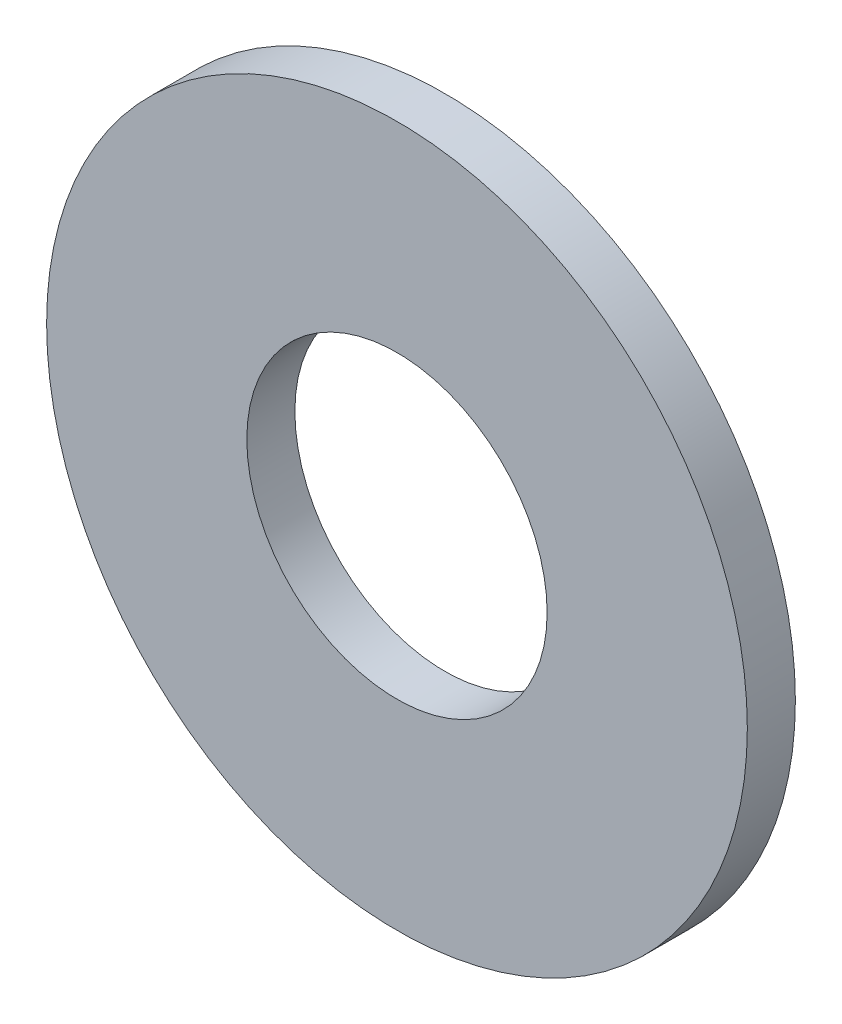
ISO-10303-21;
HEADER;
FILE_DESCRIPTION(('STEP AP214'),'2;1');
FILE_NAME('part.step','',(''),(''),'','','');
FILE_SCHEMA(('AUTOMOTIVE_DESIGN { 1 0 10303 214 1 1 1 1 }'));
ENDSEC;
DATA;
#1=APPLICATION_CONTEXT('core data for automotive mechanical design processes');
#2=APPLICATION_PROTOCOL_DEFINITION('international standard','automotive_design',2000,#1);
#3=PRODUCT_CONTEXT('',#1,'mechanical');
#4=PRODUCT('Part','Part','',(#3));
#5=PRODUCT_RELATED_PRODUCT_CATEGORY('part','',(#4));
#6=PRODUCT_DEFINITION_FORMATION('','',#4);
#7=PRODUCT_DEFINITION_CONTEXT('part definition',#1,'design');
#8=PRODUCT_DEFINITION('design','',#6,#7);
#9=PRODUCT_DEFINITION_SHAPE('','',#8);
#10=(LENGTH_UNIT() NAMED_UNIT(*) SI_UNIT(.MILLI.,.METRE.));
#11=(NAMED_UNIT(*) PLANE_ANGLE_UNIT() SI_UNIT($,.RADIAN.));
#12=(NAMED_UNIT(*) SI_UNIT($,.STERADIAN.) SOLID_ANGLE_UNIT());
#13=UNCERTAINTY_MEASURE_WITH_UNIT(LENGTH_MEASURE(1.E-05),#10,'distance_accuracy_value','');
#14=(GEOMETRIC_REPRESENTATION_CONTEXT(3) GLOBAL_UNCERTAINTY_ASSIGNED_CONTEXT((#13)) GLOBAL_UNIT_ASSIGNED_CONTEXT((#10,
#11,#12)) REPRESENTATION_CONTEXT('',''));
#15=CARTESIAN_POINT('',(0.,0.,0.));
#16=DIRECTION('',(0.,0.,1.));
#17=DIRECTION('',(1.,0.,0.));
#18=AXIS2_PLACEMENT_3D('',#15,#16,#17);
#19=CARTESIAN_POINT('',(0.,0.,-0.762));
#20=DIRECTION('',(0.,0.,1.));
#21=DIRECTION('',(1.,0.,0.));
#22=AXIS2_PLACEMENT_3D('',#19,#20,#21);
#23=CYLINDRICAL_SURFACE('',#22,5.55625);
#24=CARTESIAN_POINT('',(0.,0.,-0.762));
#25=DIRECTION('',(0.,0.,1.));
#26=DIRECTION('',(1.,0.,0.));
#27=AXIS2_PLACEMENT_3D('',#24,#25,#26);
#28=CIRCLE('',#27,5.55625);
#29=CARTESIAN_POINT('',(5.55625,0.,-0.762));
#30=VERTEX_POINT('',#29);
#31=EDGE_CURVE('E10',#30,#30,#28,.T.);
#32=ORIENTED_EDGE('',*,*,#31,.T.);
#33=EDGE_LOOP('',(#32));
#34=FACE_BOUND('',#33,.T.);
#35=CARTESIAN_POINT('',(0.,0.,0.));
#36=DIRECTION('',(0.,0.,1.));
#37=DIRECTION('',(1.,0.,0.));
#38=AXIS2_PLACEMENT_3D('',#35,#36,#37);
#39=CIRCLE('',#38,5.55625);
#40=CARTESIAN_POINT('',(5.55625,0.,0.));
#41=VERTEX_POINT('',#40);
#42=EDGE_CURVE('E32',#41,#41,#39,.T.);
#43=ORIENTED_EDGE('',*,*,#42,.F.);
#44=EDGE_LOOP('',(#43));
#45=FACE_BOUND('',#44,.T.);
#46=ADVANCED_FACE('F29',(#34,#45),#23,.T.);
#47=CARTESIAN_POINT('',(0.,0.,-0.762));
#48=DIRECTION('',(0.,0.,1.));
#49=DIRECTION('',(1.,0.,0.));
#50=AXIS2_PLACEMENT_3D('',#47,#48,#49);
#51=PLANE('',#50);
#52=CARTESIAN_POINT('',(0.,0.,-0.762));
#53=DIRECTION('',(0.,0.,1.));
#54=DIRECTION('',(1.,0.,0.));
#55=AXIS2_PLACEMENT_3D('',#52,#53,#54);
#56=CIRCLE('',#55,2.38125);
#57=CARTESIAN_POINT('',(2.38125,0.,-0.762));
#58=VERTEX_POINT('',#57);
#59=EDGE_CURVE('E39',#58,#58,#56,.T.);
#60=ORIENTED_EDGE('',*,*,#59,.T.);
#61=EDGE_LOOP('',(#60));
#62=FACE_BOUND('',#61,.T.);
#63=ORIENTED_EDGE('',*,*,#31,.F.);
#64=EDGE_LOOP('',(#63));
#65=FACE_BOUND('',#64,.T.);
#66=ADVANCED_FACE('F47',(#62,#65),#51,.F.);
#67=CARTESIAN_POINT('',(0.,0.,0.));
#68=DIRECTION('',(0.,0.,1.));
#69=DIRECTION('',(1.,0.,0.));
#70=AXIS2_PLACEMENT_3D('',#67,#68,#69);
#71=PLANE('',#70);
#72=CARTESIAN_POINT('',(0.,0.,0.));
#73=DIRECTION('',(0.,0.,1.));
#74=DIRECTION('',(1.,0.,0.));
#75=AXIS2_PLACEMENT_3D('',#72,#73,#74);
#76=CIRCLE('',#75,2.38125);
#77=CARTESIAN_POINT('',(2.38125,0.,0.));
#78=VERTEX_POINT('',#77);
#79=EDGE_CURVE('E41',#78,#78,#76,.T.);
#80=ORIENTED_EDGE('',*,*,#79,.F.);
#81=EDGE_LOOP('',(#80));
#82=FACE_BOUND('',#81,.T.);
#83=ORIENTED_EDGE('',*,*,#42,.T.);
#84=EDGE_LOOP('',(#83));
#85=FACE_BOUND('',#84,.T.);
#86=ADVANCED_FACE('F53',(#82,#85),#71,.T.);
#87=CARTESIAN_POINT('',(0.,0.,-0.762));
#88=DIRECTION('',(0.,0.,1.));
#89=DIRECTION('',(1.,0.,0.));
#90=AXIS2_PLACEMENT_3D('',#87,#88,#89);
#91=CYLINDRICAL_SURFACE('',#90,2.38125);
#92=ORIENTED_EDGE('',*,*,#59,.F.);
#93=EDGE_LOOP('',(#92));
#94=FACE_BOUND('',#93,.T.);
#95=ORIENTED_EDGE('',*,*,#79,.T.);
#96=EDGE_LOOP('',(#95));
#97=FACE_BOUND('',#96,.T.);
#98=ADVANCED_FACE('F50',(#94,#97),#91,.F.);
#99=CLOSED_SHELL('',(#46,#66,#86,#98));
#100=MANIFOLD_SOLID_BREP('B2',#99);
#101=ADVANCED_BREP_SHAPE_REPRESENTATION('',(#18,#100),#14);
#102=SHAPE_DEFINITION_REPRESENTATION(#9,#101);
ENDSEC;
END-ISO-10303-21;
